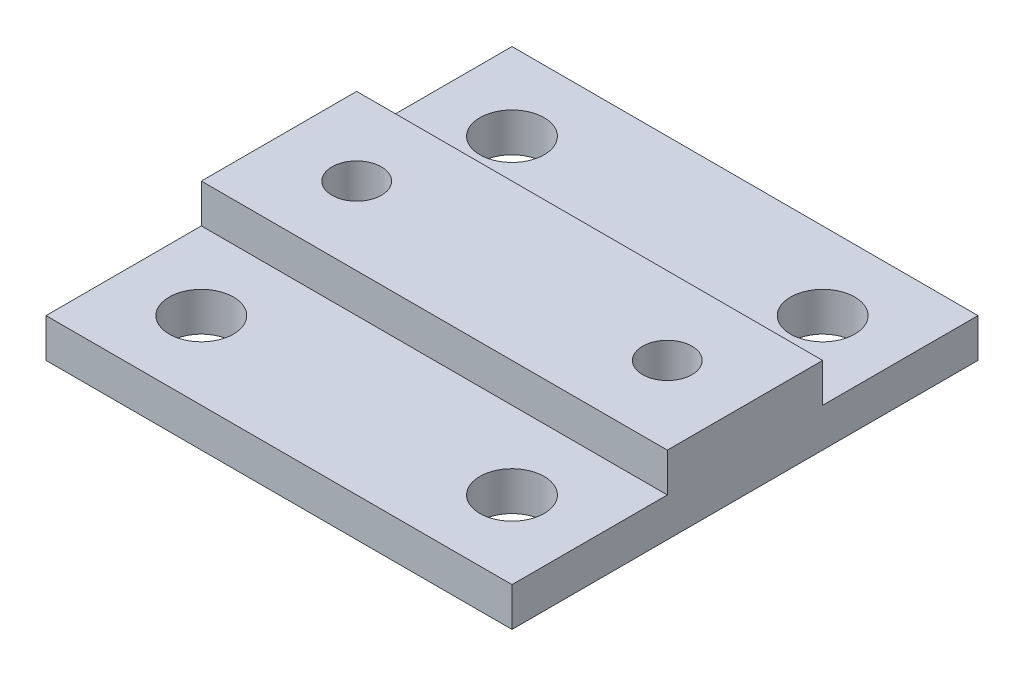
ISO-10303-21;
HEADER;
FILE_DESCRIPTION(('STEP AP214'),'2;1');
FILE_NAME('part.step','',(''),(''),'','','');
FILE_SCHEMA(('AUTOMOTIVE_DESIGN { 1 0 10303 214 1 1 1 1 }'));
ENDSEC;
DATA;
#1=APPLICATION_CONTEXT('core data for automotive mechanical design processes');
#2=APPLICATION_PROTOCOL_DEFINITION('international standard','automotive_design',2000,#1);
#3=PRODUCT_CONTEXT('',#1,'mechanical');
#4=PRODUCT('Part','Part','',(#3));
#5=PRODUCT_RELATED_PRODUCT_CATEGORY('part','',(#4));
#6=PRODUCT_DEFINITION_FORMATION('','',#4);
#7=PRODUCT_DEFINITION_CONTEXT('part definition',#1,'design');
#8=PRODUCT_DEFINITION('design','',#6,#7);
#9=PRODUCT_DEFINITION_SHAPE('','',#8);
#10=(LENGTH_UNIT() NAMED_UNIT(*) SI_UNIT(.MILLI.,.METRE.));
#11=(NAMED_UNIT(*) PLANE_ANGLE_UNIT() SI_UNIT($,.RADIAN.));
#12=(NAMED_UNIT(*) SI_UNIT($,.STERADIAN.) SOLID_ANGLE_UNIT());
#13=UNCERTAINTY_MEASURE_WITH_UNIT(LENGTH_MEASURE(1.E-05),#10,'distance_accuracy_value','');
#14=(GEOMETRIC_REPRESENTATION_CONTEXT(3) GLOBAL_UNCERTAINTY_ASSIGNED_CONTEXT((#13)) GLOBAL_UNIT_ASSIGNED_CONTEXT((#10,
#11,#12)) REPRESENTATION_CONTEXT('',''));
#15=CARTESIAN_POINT('',(0.,0.,0.));
#16=DIRECTION('',(0.,0.,1.));
#17=DIRECTION('',(1.,0.,0.));
#18=AXIS2_PLACEMENT_3D('',#15,#16,#17);
#19=CARTESIAN_POINT('',(19.05,6.35,-19.05));
#20=DIRECTION('',(0.,0.,1.));
#21=DIRECTION('',(1.,0.,0.));
#22=AXIS2_PLACEMENT_3D('',#19,#20,#21);
#23=PLANE('',#22);
#24=DIRECTION('',(-1.,0.,0.));
#25=VECTOR('',#24,1.);
#26=CARTESIAN_POINT('',(-19.05,3.175,-19.05));
#27=LINE('',#26,#25);
#28=CARTESIAN_POINT('',(19.05,3.175,-19.05));
#29=VERTEX_POINT('',#28);
#30=CARTESIAN_POINT('',(-19.05,3.175,-19.05));
#31=VERTEX_POINT('',#30);
#32=EDGE_CURVE('E110',#29,#31,#27,.T.);
#33=ORIENTED_EDGE('',*,*,#32,.F.);
#34=DIRECTION('',(0.,-1.,0.));
#35=VECTOR('',#34,1.);
#36=CARTESIAN_POINT('',(19.05,6.35,-19.05));
#37=LINE('',#36,#35);
#38=CARTESIAN_POINT('',(19.05,0.,-19.05));
#39=VERTEX_POINT('',#38);
#40=EDGE_CURVE('E187',#29,#39,#37,.T.);
#41=ORIENTED_EDGE('',*,*,#40,.T.);
#42=DIRECTION('',(-1.,0.,0.));
#43=VECTOR('',#42,1.);
#44=CARTESIAN_POINT('',(19.05,0.,-19.05));
#45=LINE('',#44,#43);
#46=CARTESIAN_POINT('',(-19.05,0.,-19.05));
#47=VERTEX_POINT('',#46);
#48=EDGE_CURVE('E172',#39,#47,#45,.T.);
#49=ORIENTED_EDGE('',*,*,#48,.T.);
#50=DIRECTION('',(0.,-1.,0.));
#51=VECTOR('',#50,1.);
#52=CARTESIAN_POINT('',(-19.05,6.35,-19.05));
#53=LINE('',#52,#51);
#54=EDGE_CURVE('E175',#31,#47,#53,.T.);
#55=ORIENTED_EDGE('',*,*,#54,.F.);
#56=EDGE_LOOP('',(#33,#41,#49,#55));
#57=FACE_BOUND('',#56,.T.);
#58=ADVANCED_FACE('F33',(#57),#23,.F.);
#59=CARTESIAN_POINT('',(-12.7,6.35,-12.7));
#60=DIRECTION('',(0.,-1.,0.));
#61=DIRECTION('',(0.,0.,-1.));
#62=AXIS2_PLACEMENT_3D('',#59,#60,#61);
#63=CYLINDRICAL_SURFACE('',#62,2.6289);
#64=CARTESIAN_POINT('',(-12.7,0.,-12.7));
#65=DIRECTION('',(0.,1.,0.));
#66=DIRECTION('',(0.,0.,1.));
#67=AXIS2_PLACEMENT_3D('',#64,#65,#66);
#68=CIRCLE('',#67,2.6289);
#69=CARTESIAN_POINT('',(-12.7,0.,-10.0711));
#70=VERTEX_POINT('',#69);
#71=EDGE_CURVE('E154',#70,#70,#68,.T.);
#72=ORIENTED_EDGE('',*,*,#71,.F.);
#73=EDGE_LOOP('',(#72));
#74=FACE_BOUND('',#73,.T.);
#75=CARTESIAN_POINT('',(-12.7,3.175,-12.7));
#76=DIRECTION('',(0.,1.,0.));
#77=DIRECTION('',(0.,0.,1.));
#78=AXIS2_PLACEMENT_3D('',#75,#76,#77);
#79=CIRCLE('',#78,2.6289);
#80=CARTESIAN_POINT('',(-12.7,3.175,-10.0711));
#81=VERTEX_POINT('',#80);
#82=EDGE_CURVE('E142',#81,#81,#79,.T.);
#83=ORIENTED_EDGE('',*,*,#82,.T.);
#84=EDGE_LOOP('',(#83));
#85=FACE_BOUND('',#84,.T.);
#86=ADVANCED_FACE('F221',(#74,#85),#63,.F.);
#87=CARTESIAN_POINT('',(12.7,6.35,-12.7));
#88=DIRECTION('',(0.,-1.,0.));
#89=DIRECTION('',(0.,0.,-1.));
#90=AXIS2_PLACEMENT_3D('',#87,#88,#89);
#91=CYLINDRICAL_SURFACE('',#90,2.6289);
#92=CARTESIAN_POINT('',(12.7,0.,-12.7));
#93=DIRECTION('',(0.,1.,0.));
#94=DIRECTION('',(0.,0.,-1.));
#95=AXIS2_PLACEMENT_3D('',#92,#93,#94);
#96=CIRCLE('',#95,2.6289);
#97=CARTESIAN_POINT('',(12.7,0.,-15.3289));
#98=VERTEX_POINT('',#97);
#99=EDGE_CURVE('E151',#98,#98,#96,.T.);
#100=ORIENTED_EDGE('',*,*,#99,.F.);
#101=EDGE_LOOP('',(#100));
#102=FACE_BOUND('',#101,.T.);
#103=CARTESIAN_POINT('',(12.7,3.175,-12.7));
#104=DIRECTION('',(0.,1.,0.));
#105=DIRECTION('',(0.,0.,1.));
#106=AXIS2_PLACEMENT_3D('',#103,#104,#105);
#107=CIRCLE('',#106,2.6289);
#108=CARTESIAN_POINT('',(12.7,3.175,-10.0711));
#109=VERTEX_POINT('',#108);
#110=EDGE_CURVE('E37',#109,#109,#107,.T.);
#111=ORIENTED_EDGE('',*,*,#110,.T.);
#112=EDGE_LOOP('',(#111));
#113=FACE_BOUND('',#112,.T.);
#114=ADVANCED_FACE('F214',(#102,#113),#91,.F.);
#115=CARTESIAN_POINT('',(0.,6.35,0.));
#116=DIRECTION('',(0.,1.,0.));
#117=DIRECTION('',(0.,0.,1.));
#118=AXIS2_PLACEMENT_3D('',#115,#116,#117);
#119=PLANE('',#118);
#120=DIRECTION('',(1.,0.,0.));
#121=VECTOR('',#120,1.);
#122=CARTESIAN_POINT('',(-19.05,6.35,-6.35));
#123=LINE('',#122,#121);
#124=CARTESIAN_POINT('',(-19.05,6.35,-6.35));
#125=VERTEX_POINT('',#124);
#126=CARTESIAN_POINT('',(19.05,6.35,-6.35));
#127=VERTEX_POINT('',#126);
#128=EDGE_CURVE('E113',#125,#127,#123,.T.);
#129=ORIENTED_EDGE('',*,*,#128,.F.);
#130=DIRECTION('',(0.,0.,1.));
#131=VECTOR('',#130,1.);
#132=CARTESIAN_POINT('',(-19.05,6.35,19.05));
#133=LINE('',#132,#131);
#134=CARTESIAN_POINT('',(-19.05,6.35,6.34999999999999));
#135=VERTEX_POINT('',#134);
#136=EDGE_CURVE('E118',#125,#135,#133,.T.);
#137=ORIENTED_EDGE('',*,*,#136,.T.);
#138=DIRECTION('',(-1.,0.,0.));
#139=VECTOR('',#138,1.);
#140=CARTESIAN_POINT('',(-19.05,6.35,6.34999999999999));
#141=LINE('',#140,#139);
#142=CARTESIAN_POINT('',(19.05,6.35,6.35));
#143=VERTEX_POINT('',#142);
#144=EDGE_CURVE('E127',#143,#135,#141,.T.);
#145=ORIENTED_EDGE('',*,*,#144,.F.);
#146=DIRECTION('',(0.,0.,-1.));
#147=VECTOR('',#146,1.);
#148=CARTESIAN_POINT('',(19.05,6.35,19.05));
#149=LINE('',#148,#147);
#150=EDGE_CURVE('E171',#143,#127,#149,.T.);
#151=ORIENTED_EDGE('',*,*,#150,.T.);
#152=EDGE_LOOP('',(#129,#137,#145,#151));
#153=FACE_BOUND('',#152,.T.);
#154=CARTESIAN_POINT('',(-12.7,6.35,0.));
#155=DIRECTION('',(0.,1.,0.));
#156=DIRECTION('',(0.,0.,1.));
#157=AXIS2_PLACEMENT_3D('',#154,#155,#156);
#158=CIRCLE('',#157,2.0193);
#159=CARTESIAN_POINT('',(-12.7,6.35,2.0193));
#160=VERTEX_POINT('',#159);
#161=EDGE_CURVE('E164',#160,#160,#158,.T.);
#162=ORIENTED_EDGE('',*,*,#161,.F.);
#163=EDGE_LOOP('',(#162));
#164=FACE_BOUND('',#163,.T.);
#165=CARTESIAN_POINT('',(12.7,6.35,0.));
#166=DIRECTION('',(0.,1.,0.));
#167=DIRECTION('',(0.,0.,-1.));
#168=AXIS2_PLACEMENT_3D('',#165,#166,#167);
#169=CIRCLE('',#168,2.0193);
#170=CARTESIAN_POINT('',(12.7,6.35,-2.0193));
#171=VERTEX_POINT('',#170);
#172=EDGE_CURVE('E158',#171,#171,#169,.T.);
#173=ORIENTED_EDGE('',*,*,#172,.F.);
#174=EDGE_LOOP('',(#173));
#175=FACE_BOUND('',#174,.T.);
#176=ADVANCED_FACE('F204',(#153,#164,#175),#119,.T.);
#177=CARTESIAN_POINT('',(0.,0.,0.));
#178=DIRECTION('',(0.,1.,0.));
#179=DIRECTION('',(0.,0.,1.));
#180=AXIS2_PLACEMENT_3D('',#177,#178,#179);
#181=PLANE('',#180);
#182=DIRECTION('',(0.,0.,1.));
#183=VECTOR('',#182,1.);
#184=CARTESIAN_POINT('',(-19.05,0.,19.05));
#185=LINE('',#184,#183);
#186=CARTESIAN_POINT('',(-19.05,0.,19.05));
#187=VERTEX_POINT('',#186);
#188=EDGE_CURVE('E167',#47,#187,#185,.T.);
#189=ORIENTED_EDGE('',*,*,#188,.F.);
#190=ORIENTED_EDGE('',*,*,#48,.F.);
#191=DIRECTION('',(0.,0.,-1.));
#192=VECTOR('',#191,1.);
#193=CARTESIAN_POINT('',(19.05,0.,19.05));
#194=LINE('',#193,#192);
#195=CARTESIAN_POINT('',(19.05,0.,19.05));
#196=VERTEX_POINT('',#195);
#197=EDGE_CURVE('E181',#196,#39,#194,.T.);
#198=ORIENTED_EDGE('',*,*,#197,.F.);
#199=DIRECTION('',(1.,0.,0.));
#200=VECTOR('',#199,1.);
#201=CARTESIAN_POINT('',(19.05,0.,19.05));
#202=LINE('',#201,#200);
#203=EDGE_CURVE('E178',#187,#196,#202,.T.);
#204=ORIENTED_EDGE('',*,*,#203,.F.);
#205=EDGE_LOOP('',(#189,#190,#198,#204));
#206=FACE_BOUND('',#205,.T.);
#207=CARTESIAN_POINT('',(-12.7,0.,0.));
#208=DIRECTION('',(0.,1.,0.));
#209=DIRECTION('',(0.,0.,1.));
#210=AXIS2_PLACEMENT_3D('',#207,#208,#209);
#211=CIRCLE('',#210,2.0193);
#212=CARTESIAN_POINT('',(-12.7,0.,2.0193));
#213=VERTEX_POINT('',#212);
#214=EDGE_CURVE('E161',#213,#213,#211,.T.);
#215=ORIENTED_EDGE('',*,*,#214,.T.);
#216=EDGE_LOOP('',(#215));
#217=FACE_BOUND('',#216,.T.);
#218=CARTESIAN_POINT('',(12.7,0.,0.));
#219=DIRECTION('',(0.,1.,0.));
#220=DIRECTION('',(0.,0.,-1.));
#221=AXIS2_PLACEMENT_3D('',#218,#219,#220);
#222=CIRCLE('',#221,2.0193);
#223=CARTESIAN_POINT('',(12.7,0.,-2.0193));
#224=VERTEX_POINT('',#223);
#225=EDGE_CURVE('E157',#224,#224,#222,.T.);
#226=ORIENTED_EDGE('',*,*,#225,.T.);
#227=EDGE_LOOP('',(#226));
#228=FACE_BOUND('',#227,.T.);
#229=ORIENTED_EDGE('',*,*,#71,.T.);
#230=EDGE_LOOP('',(#229));
#231=FACE_BOUND('',#230,.T.);
#232=ORIENTED_EDGE('',*,*,#99,.T.);
#233=EDGE_LOOP('',(#232));
#234=FACE_BOUND('',#233,.T.);
#235=CARTESIAN_POINT('',(12.7,0.,12.7));
#236=DIRECTION('',(0.,1.,0.));
#237=DIRECTION('',(0.,0.,1.));
#238=AXIS2_PLACEMENT_3D('',#235,#236,#237);
#239=CIRCLE('',#238,2.6289);
#240=CARTESIAN_POINT('',(12.7,0.,15.3289));
#241=VERTEX_POINT('',#240);
#242=EDGE_CURVE('E148',#241,#241,#239,.T.);
#243=ORIENTED_EDGE('',*,*,#242,.T.);
#244=EDGE_LOOP('',(#243));
#245=FACE_BOUND('',#244,.T.);
#246=CARTESIAN_POINT('',(-12.7,0.,12.7));
#247=DIRECTION('',(0.,1.,0.));
#248=DIRECTION('',(0.,0.,-1.));
#249=AXIS2_PLACEMENT_3D('',#246,#247,#248);
#250=CIRCLE('',#249,2.6289);
#251=CARTESIAN_POINT('',(-12.7,0.,10.0711));
#252=VERTEX_POINT('',#251);
#253=EDGE_CURVE('E145',#252,#252,#250,.T.);
#254=ORIENTED_EDGE('',*,*,#253,.T.);
#255=EDGE_LOOP('',(#254));
#256=FACE_BOUND('',#255,.T.);
#257=ADVANCED_FACE('F202',(#206,#217,#228,#231,#234,#245,#256),#181,.F.);
#258=CARTESIAN_POINT('',(-19.05,6.35,19.05));
#259=DIRECTION('',(1.,0.,0.));
#260=DIRECTION('',(0.,0.,-1.));
#261=AXIS2_PLACEMENT_3D('',#258,#259,#260);
#262=PLANE('',#261);
#263=ORIENTED_EDGE('',*,*,#136,.F.);
#264=DIRECTION('',(0.,1.,0.));
#265=VECTOR('',#264,1.);
#266=CARTESIAN_POINT('',(-19.05,3.175,-6.35));
#267=LINE('',#266,#265);
#268=CARTESIAN_POINT('',(-19.05,3.175,-6.35));
#269=VERTEX_POINT('',#268);
#270=EDGE_CURVE('E102',#269,#125,#267,.T.);
#271=ORIENTED_EDGE('',*,*,#270,.F.);
#272=DIRECTION('',(0.,0.,1.));
#273=VECTOR('',#272,1.);
#274=CARTESIAN_POINT('',(-19.05,3.175,-19.05));
#275=LINE('',#274,#273);
#276=EDGE_CURVE('E106',#31,#269,#275,.T.);
#277=ORIENTED_EDGE('',*,*,#276,.F.);
#278=ORIENTED_EDGE('',*,*,#54,.T.);
#279=ORIENTED_EDGE('',*,*,#188,.T.);
#280=DIRECTION('',(0.,-1.,0.));
#281=VECTOR('',#280,1.);
#282=CARTESIAN_POINT('',(-19.05,6.35,19.05));
#283=LINE('',#282,#281);
#284=CARTESIAN_POINT('',(-19.05,3.175,19.05));
#285=VERTEX_POINT('',#284);
#286=EDGE_CURVE('E11',#285,#187,#283,.T.);
#287=ORIENTED_EDGE('',*,*,#286,.F.);
#288=DIRECTION('',(0.,0.,1.));
#289=VECTOR('',#288,1.);
#290=CARTESIAN_POINT('',(-19.05,3.175,19.05));
#291=LINE('',#290,#289);
#292=CARTESIAN_POINT('',(-19.05,3.175,6.34999999999999));
#293=VERTEX_POINT('',#292);
#294=EDGE_CURVE('E125',#293,#285,#291,.T.);
#295=ORIENTED_EDGE('',*,*,#294,.F.);
#296=DIRECTION('',(0.,1.,0.));
#297=VECTOR('',#296,1.);
#298=CARTESIAN_POINT('',(-19.05,3.175,6.34999999999999));
#299=LINE('',#298,#297);
#300=EDGE_CURVE('E136',#293,#135,#299,.T.);
#301=ORIENTED_EDGE('',*,*,#300,.T.);
#302=EDGE_LOOP('',(#263,#271,#277,#278,#279,#287,#295,#301));
#303=FACE_BOUND('',#302,.T.);
#304=ADVANCED_FACE('F35',(#303),#262,.F.);
#305=CARTESIAN_POINT('',(19.05,6.35,19.05));
#306=DIRECTION('',(0.,0.,-1.));
#307=DIRECTION('',(-1.,0.,0.));
#308=AXIS2_PLACEMENT_3D('',#305,#306,#307);
#309=PLANE('',#308);
#310=DIRECTION('',(0.,-1.,0.));
#311=VECTOR('',#310,1.);
#312=CARTESIAN_POINT('',(19.05,6.35,19.05));
#313=LINE('',#312,#311);
#314=CARTESIAN_POINT('',(19.05,3.175,19.05));
#315=VERTEX_POINT('',#314);
#316=EDGE_CURVE('E42',#315,#196,#313,.T.);
#317=ORIENTED_EDGE('',*,*,#316,.F.);
#318=DIRECTION('',(1.,0.,0.));
#319=VECTOR('',#318,1.);
#320=CARTESIAN_POINT('',(-19.05,3.175,19.05));
#321=LINE('',#320,#319);
#322=EDGE_CURVE('E50',#285,#315,#321,.T.);
#323=ORIENTED_EDGE('',*,*,#322,.F.);
#324=ORIENTED_EDGE('',*,*,#286,.T.);
#325=ORIENTED_EDGE('',*,*,#203,.T.);
#326=EDGE_LOOP('',(#317,#323,#324,#325));
#327=FACE_BOUND('',#326,.T.);
#328=ADVANCED_FACE('F212',(#327),#309,.F.);
#329=CARTESIAN_POINT('',(19.05,6.35,19.05));
#330=DIRECTION('',(-1.,0.,0.));
#331=DIRECTION('',(0.,0.,1.));
#332=AXIS2_PLACEMENT_3D('',#329,#330,#331);
#333=PLANE('',#332);
#334=DIRECTION('',(0.,0.,-1.));
#335=VECTOR('',#334,1.);
#336=CARTESIAN_POINT('',(19.05,3.175,-19.05));
#337=LINE('',#336,#335);
#338=CARTESIAN_POINT('',(19.05,3.175,-6.35));
#339=VERTEX_POINT('',#338);
#340=EDGE_CURVE('E58',#339,#29,#337,.T.);
#341=ORIENTED_EDGE('',*,*,#340,.F.);
#342=DIRECTION('',(0.,1.,0.));
#343=VECTOR('',#342,1.);
#344=CARTESIAN_POINT('',(19.05,3.175,-6.35));
#345=LINE('',#344,#343);
#346=EDGE_CURVE('E105',#339,#127,#345,.T.);
#347=ORIENTED_EDGE('',*,*,#346,.T.);
#348=ORIENTED_EDGE('',*,*,#150,.F.);
#349=DIRECTION('',(0.,1.,0.));
#350=VECTOR('',#349,1.);
#351=CARTESIAN_POINT('',(19.05,3.175,6.35));
#352=LINE('',#351,#350);
#353=CARTESIAN_POINT('',(19.05,3.175,6.35));
#354=VERTEX_POINT('',#353);
#355=EDGE_CURVE('E134',#354,#143,#352,.T.);
#356=ORIENTED_EDGE('',*,*,#355,.F.);
#357=DIRECTION('',(0.,0.,-1.));
#358=VECTOR('',#357,1.);
#359=CARTESIAN_POINT('',(19.05,3.175,19.05));
#360=LINE('',#359,#358);
#361=EDGE_CURVE('E129',#315,#354,#360,.T.);
#362=ORIENTED_EDGE('',*,*,#361,.F.);
#363=ORIENTED_EDGE('',*,*,#316,.T.);
#364=ORIENTED_EDGE('',*,*,#197,.T.);
#365=ORIENTED_EDGE('',*,*,#40,.F.);
#366=EDGE_LOOP('',(#341,#347,#348,#356,#362,#363,#364,#365));
#367=FACE_BOUND('',#366,.T.);
#368=ADVANCED_FACE('F230',(#367),#333,.F.);
#369=CARTESIAN_POINT('',(-12.7,6.35,0.));
#370=DIRECTION('',(0.,-1.,0.));
#371=DIRECTION('',(0.,0.,-1.));
#372=AXIS2_PLACEMENT_3D('',#369,#370,#371);
#373=CYLINDRICAL_SURFACE('',#372,2.0193);
#374=ORIENTED_EDGE('',*,*,#161,.T.);
#375=EDGE_LOOP('',(#374));
#376=FACE_BOUND('',#375,.T.);
#377=ORIENTED_EDGE('',*,*,#214,.F.);
#378=EDGE_LOOP('',(#377));
#379=FACE_BOUND('',#378,.T.);
#380=ADVANCED_FACE('F232',(#376,#379),#373,.F.);
#381=CARTESIAN_POINT('',(12.7,6.35,0.));
#382=DIRECTION('',(0.,-1.,0.));
#383=DIRECTION('',(0.,0.,-1.));
#384=AXIS2_PLACEMENT_3D('',#381,#382,#383);
#385=CYLINDRICAL_SURFACE('',#384,2.0193);
#386=ORIENTED_EDGE('',*,*,#172,.T.);
#387=EDGE_LOOP('',(#386));
#388=FACE_BOUND('',#387,.T.);
#389=ORIENTED_EDGE('',*,*,#225,.F.);
#390=EDGE_LOOP('',(#389));
#391=FACE_BOUND('',#390,.T.);
#392=ADVANCED_FACE('F256',(#388,#391),#385,.F.);
#393=CARTESIAN_POINT('',(12.7,6.35,12.7));
#394=DIRECTION('',(0.,-1.,0.));
#395=DIRECTION('',(0.,0.,-1.));
#396=AXIS2_PLACEMENT_3D('',#393,#394,#395);
#397=CYLINDRICAL_SURFACE('',#396,2.6289);
#398=CARTESIAN_POINT('',(12.7,3.175,12.7));
#399=DIRECTION('',(0.,-1.,0.));
#400=DIRECTION('',(0.,0.,-1.));
#401=AXIS2_PLACEMENT_3D('',#398,#399,#400);
#402=CIRCLE('',#401,2.6289);
#403=CARTESIAN_POINT('',(12.7,3.175,10.0711));
#404=VERTEX_POINT('',#403);
#405=EDGE_CURVE('E139',#404,#404,#402,.T.);
#406=ORIENTED_EDGE('',*,*,#405,.F.);
#407=EDGE_LOOP('',(#406));
#408=FACE_BOUND('',#407,.T.);
#409=ORIENTED_EDGE('',*,*,#242,.F.);
#410=EDGE_LOOP('',(#409));
#411=FACE_BOUND('',#410,.T.);
#412=ADVANCED_FACE('F198',(#408,#411),#397,.F.);
#413=CARTESIAN_POINT('',(-12.7,6.35,12.7));
#414=DIRECTION('',(0.,-1.,0.));
#415=DIRECTION('',(0.,0.,-1.));
#416=AXIS2_PLACEMENT_3D('',#413,#414,#415);
#417=CYLINDRICAL_SURFACE('',#416,2.6289);
#418=CARTESIAN_POINT('',(-12.7,3.175,12.7));
#419=DIRECTION('',(0.,-1.,0.));
#420=DIRECTION('',(0.,0.,-1.));
#421=AXIS2_PLACEMENT_3D('',#418,#419,#420);
#422=CIRCLE('',#421,2.6289);
#423=CARTESIAN_POINT('',(-12.7,3.175,10.0711));
#424=VERTEX_POINT('',#423);
#425=EDGE_CURVE('E120',#424,#424,#422,.T.);
#426=ORIENTED_EDGE('',*,*,#425,.F.);
#427=EDGE_LOOP('',(#426));
#428=FACE_BOUND('',#427,.T.);
#429=ORIENTED_EDGE('',*,*,#253,.F.);
#430=EDGE_LOOP('',(#429));
#431=FACE_BOUND('',#430,.T.);
#432=ADVANCED_FACE('F194',(#428,#431),#417,.F.);
#433=CARTESIAN_POINT('',(-19.05,3.175,6.34999999999999));
#434=DIRECTION('',(0.,0.,-1.));
#435=DIRECTION('',(-1.,0.,0.));
#436=AXIS2_PLACEMENT_3D('',#433,#434,#435);
#437=PLANE('',#436);
#438=ORIENTED_EDGE('',*,*,#144,.T.);
#439=ORIENTED_EDGE('',*,*,#300,.F.);
#440=DIRECTION('',(-1.,0.,0.));
#441=VECTOR('',#440,1.);
#442=CARTESIAN_POINT('',(-19.05,3.175,6.34999999999999));
#443=LINE('',#442,#441);
#444=EDGE_CURVE('E131',#354,#293,#443,.T.);
#445=ORIENTED_EDGE('',*,*,#444,.F.);
#446=ORIENTED_EDGE('',*,*,#355,.T.);
#447=EDGE_LOOP('',(#438,#439,#445,#446));
#448=FACE_BOUND('',#447,.T.);
#449=ADVANCED_FACE('F197',(#448),#437,.F.);
#450=CARTESIAN_POINT('',(0.,3.175,0.));
#451=DIRECTION('',(0.,-1.,0.));
#452=DIRECTION('',(0.,0.,-1.));
#453=AXIS2_PLACEMENT_3D('',#450,#451,#452);
#454=PLANE('',#453);
#455=ORIENTED_EDGE('',*,*,#405,.T.);
#456=EDGE_LOOP('',(#455));
#457=FACE_BOUND('',#456,.T.);
#458=ORIENTED_EDGE('',*,*,#425,.T.);
#459=EDGE_LOOP('',(#458));
#460=FACE_BOUND('',#459,.T.);
#461=ORIENTED_EDGE('',*,*,#294,.T.);
#462=ORIENTED_EDGE('',*,*,#322,.T.);
#463=ORIENTED_EDGE('',*,*,#361,.T.);
#464=ORIENTED_EDGE('',*,*,#444,.T.);
#465=EDGE_LOOP('',(#461,#462,#463,#464));
#466=FACE_BOUND('',#465,.T.);
#467=ADVANCED_FACE('F192',(#457,#460,#466),#454,.F.);
#468=CARTESIAN_POINT('',(-19.05,3.175,-6.35));
#469=DIRECTION('',(0.,0.,1.));
#470=DIRECTION('',(1.,0.,0.));
#471=AXIS2_PLACEMENT_3D('',#468,#469,#470);
#472=PLANE('',#471);
#473=ORIENTED_EDGE('',*,*,#128,.T.);
#474=ORIENTED_EDGE('',*,*,#346,.F.);
#475=DIRECTION('',(1.,0.,0.));
#476=VECTOR('',#475,1.);
#477=CARTESIAN_POINT('',(-19.05,3.175,-6.35));
#478=LINE('',#477,#476);
#479=EDGE_CURVE('E98',#269,#339,#478,.T.);
#480=ORIENTED_EDGE('',*,*,#479,.F.);
#481=ORIENTED_EDGE('',*,*,#270,.T.);
#482=EDGE_LOOP('',(#473,#474,#480,#481));
#483=FACE_BOUND('',#482,.T.);
#484=ADVANCED_FACE('F100',(#483),#472,.F.);
#485=CARTESIAN_POINT('',(0.,3.175,0.));
#486=DIRECTION('',(0.,1.,0.));
#487=DIRECTION('',(0.,0.,1.));
#488=AXIS2_PLACEMENT_3D('',#485,#486,#487);
#489=PLANE('',#488);
#490=ORIENTED_EDGE('',*,*,#82,.F.);
#491=EDGE_LOOP('',(#490));
#492=FACE_BOUND('',#491,.T.);
#493=ORIENTED_EDGE('',*,*,#110,.F.);
#494=EDGE_LOOP('',(#493));
#495=FACE_BOUND('',#494,.T.);
#496=ORIENTED_EDGE('',*,*,#276,.T.);
#497=ORIENTED_EDGE('',*,*,#479,.T.);
#498=ORIENTED_EDGE('',*,*,#340,.T.);
#499=ORIENTED_EDGE('',*,*,#32,.T.);
#500=EDGE_LOOP('',(#496,#497,#498,#499));
#501=FACE_BOUND('',#500,.T.);
#502=ADVANCED_FACE('F109',(#492,#495,#501),#489,.T.);
#503=CLOSED_SHELL('',(#58,#86,#114,#176,#257,#304,#328,#368,#380,#392,#412,#432,#449,#467,#484,#502));
#504=MANIFOLD_SOLID_BREP('B2',#503);
#505=ADVANCED_BREP_SHAPE_REPRESENTATION('',(#18,#504),#14);
#506=SHAPE_DEFINITION_REPRESENTATION(#9,#505);
ENDSEC;
END-ISO-10303-21;
